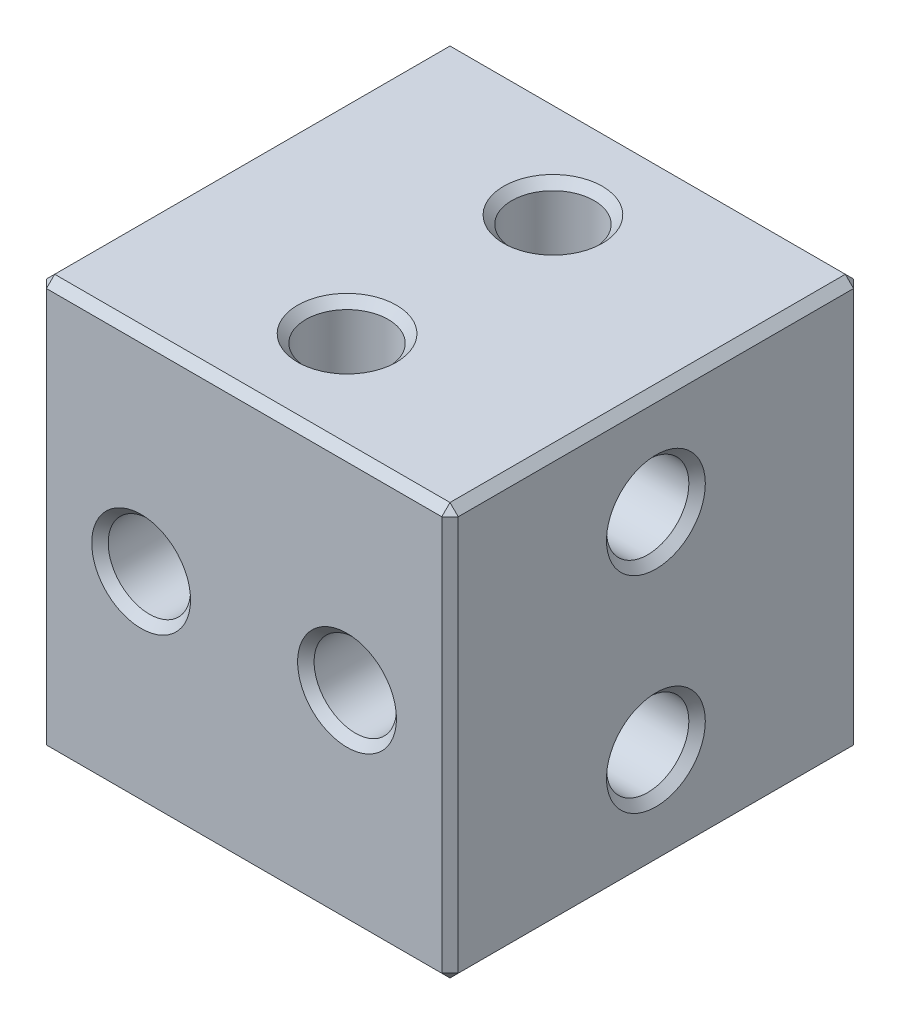
ISO-10303-21;
HEADER;
FILE_DESCRIPTION(('STEP AP214'),'2;1');
FILE_NAME('part.step','',(''),(''),'','','');
FILE_SCHEMA(('AUTOMOTIVE_DESIGN { 1 0 10303 214 1 1 1 1 }'));
ENDSEC;
DATA;
#1=APPLICATION_CONTEXT('core data for automotive mechanical design processes');
#2=APPLICATION_PROTOCOL_DEFINITION('international standard','automotive_design',2000,#1);
#3=PRODUCT_CONTEXT('',#1,'mechanical');
#4=PRODUCT('Part','Part','',(#3));
#5=PRODUCT_RELATED_PRODUCT_CATEGORY('part','',(#4));
#6=PRODUCT_DEFINITION_FORMATION('','',#4);
#7=PRODUCT_DEFINITION_CONTEXT('part definition',#1,'design');
#8=PRODUCT_DEFINITION('design','',#6,#7);
#9=PRODUCT_DEFINITION_SHAPE('','',#8);
#10=(LENGTH_UNIT() NAMED_UNIT(*) SI_UNIT(.MILLI.,.METRE.));
#11=(NAMED_UNIT(*) PLANE_ANGLE_UNIT() SI_UNIT($,.RADIAN.));
#12=(NAMED_UNIT(*) SI_UNIT($,.STERADIAN.) SOLID_ANGLE_UNIT());
#13=UNCERTAINTY_MEASURE_WITH_UNIT(LENGTH_MEASURE(1.E-05),#10,'distance_accuracy_value','');
#14=(GEOMETRIC_REPRESENTATION_CONTEXT(3) GLOBAL_UNCERTAINTY_ASSIGNED_CONTEXT((#13)) GLOBAL_UNIT_ASSIGNED_CONTEXT((#10,
#11,#12)) REPRESENTATION_CONTEXT('',''));
#15=CARTESIAN_POINT('',(0.,0.,0.));
#16=DIRECTION('',(0.,0.,1.));
#17=DIRECTION('',(1.,0.,0.));
#18=AXIS2_PLACEMENT_3D('',#15,#16,#17);
#19=CARTESIAN_POINT('',(-5.,5.,10.));
#20=DIRECTION('',(1.,0.,0.));
#21=DIRECTION('',(0.,1.,0.));
#22=AXIS2_PLACEMENT_3D('',#19,#20,#21);
#23=PLANE('',#22);
#24=CARTESIAN_POINT('',(-5.,-2.5,5.));
#25=DIRECTION('',(1.,0.,0.));
#26=DIRECTION('',(0.,1.,0.));
#27=AXIS2_PLACEMENT_3D('',#24,#25,#26);
#28=CIRCLE('',#27,1.2);
#29=CARTESIAN_POINT('',(-5.,-1.30000000000001,5.));
#30=VERTEX_POINT('',#29);
#31=EDGE_CURVE('E245',#30,#30,#28,.T.);
#32=ORIENTED_EDGE('',*,*,#31,.T.);
#33=EDGE_LOOP('',(#32));
#34=FACE_BOUND('',#33,.T.);
#35=CARTESIAN_POINT('',(-5.,2.5,5.));
#36=DIRECTION('',(1.,0.,0.));
#37=DIRECTION('',(0.,1.,0.));
#38=AXIS2_PLACEMENT_3D('',#35,#36,#37);
#39=CIRCLE('',#38,1.2);
#40=CARTESIAN_POINT('',(-5.,3.69999999999999,5.));
#41=VERTEX_POINT('',#40);
#42=EDGE_CURVE('E242',#41,#41,#39,.T.);
#43=ORIENTED_EDGE('',*,*,#42,.T.);
#44=EDGE_LOOP('',(#43));
#45=FACE_BOUND('',#44,.T.);
#46=DIRECTION('',(0.,-1.,0.));
#47=VECTOR('',#46,1.);
#48=CARTESIAN_POINT('',(-5.,5.,0.200000000000001));
#49=LINE('',#48,#47);
#50=CARTESIAN_POINT('',(-5.,4.8,0.200000000000001));
#51=VERTEX_POINT('',#50);
#52=CARTESIAN_POINT('',(-5.,-4.8,0.200000000000001));
#53=VERTEX_POINT('',#52);
#54=EDGE_CURVE('E500',#51,#53,#49,.T.);
#55=ORIENTED_EDGE('',*,*,#54,.T.);
#56=DIRECTION('',(0.,0.,1.));
#57=VECTOR('',#56,1.);
#58=CARTESIAN_POINT('',(-5.,-4.8,10.));
#59=LINE('',#58,#57);
#60=CARTESIAN_POINT('',(-5.,-4.8,9.8));
#61=VERTEX_POINT('',#60);
#62=EDGE_CURVE('E504',#53,#61,#59,.T.);
#63=ORIENTED_EDGE('',*,*,#62,.T.);
#64=DIRECTION('',(0.,1.,0.));
#65=VECTOR('',#64,1.);
#66=CARTESIAN_POINT('',(-5.,5.,9.8));
#67=LINE('',#66,#65);
#68=CARTESIAN_POINT('',(-5.,4.8,9.8));
#69=VERTEX_POINT('',#68);
#70=EDGE_CURVE('E502',#61,#69,#67,.T.);
#71=ORIENTED_EDGE('',*,*,#70,.T.);
#72=DIRECTION('',(0.,0.,-1.));
#73=VECTOR('',#72,1.);
#74=CARTESIAN_POINT('',(-5.,4.8,10.));
#75=LINE('',#74,#73);
#76=EDGE_CURVE('E481',#69,#51,#75,.T.);
#77=ORIENTED_EDGE('',*,*,#76,.T.);
#78=EDGE_LOOP('',(#55,#63,#71,#77));
#79=FACE_BOUND('',#78,.T.);
#80=ADVANCED_FACE('F32',(#34,#45,#79),#23,.F.);
#81=CARTESIAN_POINT('',(-5.,-5.,10.));
#82=DIRECTION('',(0.,1.,0.));
#83=DIRECTION('',(0.,0.,1.));
#84=AXIS2_PLACEMENT_3D('',#81,#82,#83);
#85=PLANE('',#84);
#86=CARTESIAN_POINT('',(0.,-5.,2.5));
#87=DIRECTION('',(0.,1.,0.));
#88=DIRECTION('',(0.,0.,1.));
#89=AXIS2_PLACEMENT_3D('',#86,#87,#88);
#90=CIRCLE('',#89,1.19999999999999);
#91=CARTESIAN_POINT('',(0.,-5.,3.69999999999999));
#92=VERTEX_POINT('',#91);
#93=EDGE_CURVE('E263',#92,#92,#90,.T.);
#94=ORIENTED_EDGE('',*,*,#93,.T.);
#95=EDGE_LOOP('',(#94));
#96=FACE_BOUND('',#95,.T.);
#97=CARTESIAN_POINT('',(0.,-5.,7.5));
#98=DIRECTION('',(0.,1.,0.));
#99=DIRECTION('',(0.,0.,1.));
#100=AXIS2_PLACEMENT_3D('',#97,#98,#99);
#101=CIRCLE('',#100,1.2);
#102=CARTESIAN_POINT('',(0.,-5.,8.7));
#103=VERTEX_POINT('',#102);
#104=EDGE_CURVE('E260',#103,#103,#101,.T.);
#105=ORIENTED_EDGE('',*,*,#104,.T.);
#106=EDGE_LOOP('',(#105));
#107=FACE_BOUND('',#106,.T.);
#108=DIRECTION('',(0.,0.,1.));
#109=VECTOR('',#108,1.);
#110=CARTESIAN_POINT('',(4.8,-5.,10.));
#111=LINE('',#110,#109);
#112=CARTESIAN_POINT('',(4.8,-5.,0.200000000000001));
#113=VERTEX_POINT('',#112);
#114=CARTESIAN_POINT('',(4.8,-5.,9.8));
#115=VERTEX_POINT('',#114);
#116=EDGE_CURVE('E461',#113,#115,#111,.T.);
#117=ORIENTED_EDGE('',*,*,#116,.T.);
#118=DIRECTION('',(-1.,0.,0.));
#119=VECTOR('',#118,1.);
#120=CARTESIAN_POINT('',(-5.,-5.,9.8));
#121=LINE('',#120,#119);
#122=CARTESIAN_POINT('',(-4.8,-5.,9.8));
#123=VERTEX_POINT('',#122);
#124=EDGE_CURVE('E464',#115,#123,#121,.T.);
#125=ORIENTED_EDGE('',*,*,#124,.T.);
#126=DIRECTION('',(0.,0.,-1.));
#127=VECTOR('',#126,1.);
#128=CARTESIAN_POINT('',(-4.8,-5.,10.));
#129=LINE('',#128,#127);
#130=CARTESIAN_POINT('',(-4.8,-5.,0.200000000000001));
#131=VERTEX_POINT('',#130);
#132=EDGE_CURVE('E468',#123,#131,#129,.T.);
#133=ORIENTED_EDGE('',*,*,#132,.T.);
#134=DIRECTION('',(1.,0.,0.));
#135=VECTOR('',#134,1.);
#136=CARTESIAN_POINT('',(-5.,-5.,0.200000000000001));
#137=LINE('',#136,#135);
#138=EDGE_CURVE('E466',#131,#113,#137,.T.);
#139=ORIENTED_EDGE('',*,*,#138,.T.);
#140=EDGE_LOOP('',(#117,#125,#133,#139));
#141=FACE_BOUND('',#140,.T.);
#142=ADVANCED_FACE('F293',(#96,#107,#141),#85,.F.);
#143=CARTESIAN_POINT('',(5.,5.,10.));
#144=DIRECTION('',(-1.,0.,0.));
#145=DIRECTION('',(0.,-1.,0.));
#146=AXIS2_PLACEMENT_3D('',#143,#144,#145);
#147=PLANE('',#146);
#148=CARTESIAN_POINT('',(5.,2.5,5.));
#149=DIRECTION('',(-1.,0.,0.));
#150=DIRECTION('',(0.,-1.,0.));
#151=AXIS2_PLACEMENT_3D('',#148,#149,#150);
#152=CIRCLE('',#151,1.2);
#153=CARTESIAN_POINT('',(5.,1.3,5.));
#154=VERTEX_POINT('',#153);
#155=EDGE_CURVE('E11',#154,#154,#152,.T.);
#156=ORIENTED_EDGE('',*,*,#155,.T.);
#157=EDGE_LOOP('',(#156));
#158=FACE_BOUND('',#157,.T.);
#159=CARTESIAN_POINT('',(5.,-2.5,5.));
#160=DIRECTION('',(-1.,0.,0.));
#161=DIRECTION('',(0.,-1.,0.));
#162=AXIS2_PLACEMENT_3D('',#159,#160,#161);
#163=CIRCLE('',#162,1.19999999999999);
#164=CARTESIAN_POINT('',(5.,-3.69999999999999,5.));
#165=VERTEX_POINT('',#164);
#166=EDGE_CURVE('E40',#165,#165,#163,.T.);
#167=ORIENTED_EDGE('',*,*,#166,.T.);
#168=EDGE_LOOP('',(#167));
#169=FACE_BOUND('',#168,.T.);
#170=DIRECTION('',(0.,0.,1.));
#171=VECTOR('',#170,1.);
#172=CARTESIAN_POINT('',(5.,4.8,10.));
#173=LINE('',#172,#171);
#174=CARTESIAN_POINT('',(5.,4.8,0.200000000000001));
#175=VERTEX_POINT('',#174);
#176=CARTESIAN_POINT('',(5.,4.8,9.8));
#177=VERTEX_POINT('',#176);
#178=EDGE_CURVE('E507',#175,#177,#173,.T.);
#179=ORIENTED_EDGE('',*,*,#178,.T.);
#180=DIRECTION('',(0.,-1.,0.));
#181=VECTOR('',#180,1.);
#182=CARTESIAN_POINT('',(5.,-5.,9.8));
#183=LINE('',#182,#181);
#184=CARTESIAN_POINT('',(5.,-4.8,9.8));
#185=VERTEX_POINT('',#184);
#186=EDGE_CURVE('E153',#177,#185,#183,.T.);
#187=ORIENTED_EDGE('',*,*,#186,.T.);
#188=DIRECTION('',(0.,0.,-1.));
#189=VECTOR('',#188,1.);
#190=CARTESIAN_POINT('',(5.,-4.8,10.));
#191=LINE('',#190,#189);
#192=CARTESIAN_POINT('',(5.,-4.8,0.200000000000001));
#193=VERTEX_POINT('',#192);
#194=EDGE_CURVE('E472',#185,#193,#191,.T.);
#195=ORIENTED_EDGE('',*,*,#194,.T.);
#196=DIRECTION('',(0.,1.,0.));
#197=VECTOR('',#196,1.);
#198=CARTESIAN_POINT('',(5.,5.,0.200000000000001));
#199=LINE('',#198,#197);
#200=EDGE_CURVE('E509',#193,#175,#199,.T.);
#201=ORIENTED_EDGE('',*,*,#200,.T.);
#202=EDGE_LOOP('',(#179,#187,#195,#201));
#203=FACE_BOUND('',#202,.T.);
#204=ADVANCED_FACE('F268',(#158,#169,#203),#147,.F.);
#205=CARTESIAN_POINT('',(-5.,5.,10.));
#206=DIRECTION('',(0.,-1.,0.));
#207=DIRECTION('',(0.,0.,-1.));
#208=AXIS2_PLACEMENT_3D('',#205,#206,#207);
#209=PLANE('',#208);
#210=CARTESIAN_POINT('',(0.,5.,2.5));
#211=DIRECTION('',(0.,-1.,0.));
#212=DIRECTION('',(0.,0.,-1.));
#213=AXIS2_PLACEMENT_3D('',#210,#211,#212);
#214=CIRCLE('',#213,1.2);
#215=CARTESIAN_POINT('',(0.,5.,1.3));
#216=VERTEX_POINT('',#215);
#217=EDGE_CURVE('E233',#216,#216,#214,.T.);
#218=ORIENTED_EDGE('',*,*,#217,.T.);
#219=EDGE_LOOP('',(#218));
#220=FACE_BOUND('',#219,.T.);
#221=CARTESIAN_POINT('',(0.,5.,7.5));
#222=DIRECTION('',(0.,-1.,0.));
#223=DIRECTION('',(0.,0.,-1.));
#224=AXIS2_PLACEMENT_3D('',#221,#222,#223);
#225=CIRCLE('',#224,1.2);
#226=CARTESIAN_POINT('',(0.,5.,6.3));
#227=VERTEX_POINT('',#226);
#228=EDGE_CURVE('E230',#227,#227,#225,.T.);
#229=ORIENTED_EDGE('',*,*,#228,.T.);
#230=EDGE_LOOP('',(#229));
#231=FACE_BOUND('',#230,.T.);
#232=DIRECTION('',(-1.,0.,0.));
#233=VECTOR('',#232,1.);
#234=CARTESIAN_POINT('',(-5.,5.,0.200000000000001));
#235=LINE('',#234,#233);
#236=CARTESIAN_POINT('',(4.8,5.,0.200000000000001));
#237=VERTEX_POINT('',#236);
#238=CARTESIAN_POINT('',(-4.8,5.,0.200000000000001));
#239=VERTEX_POINT('',#238);
#240=EDGE_CURVE('E522',#237,#239,#235,.T.);
#241=ORIENTED_EDGE('',*,*,#240,.T.);
#242=DIRECTION('',(0.,0.,1.));
#243=VECTOR('',#242,1.);
#244=CARTESIAN_POINT('',(-4.8,5.,10.));
#245=LINE('',#244,#243);
#246=CARTESIAN_POINT('',(-4.8,5.,9.8));
#247=VERTEX_POINT('',#246);
#248=EDGE_CURVE('E203',#239,#247,#245,.T.);
#249=ORIENTED_EDGE('',*,*,#248,.T.);
#250=DIRECTION('',(1.,0.,0.));
#251=VECTOR('',#250,1.);
#252=CARTESIAN_POINT('',(5.,5.,9.8));
#253=LINE('',#252,#251);
#254=CARTESIAN_POINT('',(4.8,5.,9.8));
#255=VERTEX_POINT('',#254);
#256=EDGE_CURVE('E55',#247,#255,#253,.T.);
#257=ORIENTED_EDGE('',*,*,#256,.T.);
#258=DIRECTION('',(0.,0.,-1.));
#259=VECTOR('',#258,1.);
#260=CARTESIAN_POINT('',(4.8,5.,10.));
#261=LINE('',#260,#259);
#262=EDGE_CURVE('E524',#255,#237,#261,.T.);
#263=ORIENTED_EDGE('',*,*,#262,.T.);
#264=EDGE_LOOP('',(#241,#249,#257,#263));
#265=FACE_BOUND('',#264,.T.);
#266=ADVANCED_FACE('F421',(#220,#231,#265),#209,.F.);
#267=CARTESIAN_POINT('',(-5.,-5.,10.));
#268=DIRECTION('',(0.,0.,1.));
#269=DIRECTION('',(1.,0.,0.));
#270=AXIS2_PLACEMENT_3D('',#267,#268,#269);
#271=PLANE('',#270);
#272=CARTESIAN_POINT('',(-2.5,0.,10.));
#273=DIRECTION('',(0.,0.,1.));
#274=DIRECTION('',(1.,0.,0.));
#275=AXIS2_PLACEMENT_3D('',#272,#273,#274);
#276=CIRCLE('',#275,1.19999999999999);
#277=CARTESIAN_POINT('',(-1.3,0.,10.));
#278=VERTEX_POINT('',#277);
#279=EDGE_CURVE('E221',#278,#278,#276,.F.);
#280=ORIENTED_EDGE('',*,*,#279,.T.);
#281=EDGE_LOOP('',(#280));
#282=FACE_BOUND('',#281,.T.);
#283=CARTESIAN_POINT('',(2.5,0.,10.));
#284=DIRECTION('',(0.,0.,1.));
#285=DIRECTION('',(1.,0.,0.));
#286=AXIS2_PLACEMENT_3D('',#283,#284,#285);
#287=CIRCLE('',#286,1.19999999999999);
#288=CARTESIAN_POINT('',(3.7,0.,10.));
#289=VERTEX_POINT('',#288);
#290=EDGE_CURVE('E218',#289,#289,#287,.F.);
#291=ORIENTED_EDGE('',*,*,#290,.T.);
#292=EDGE_LOOP('',(#291));
#293=FACE_BOUND('',#292,.T.);
#294=DIRECTION('',(0.,-1.,0.));
#295=VECTOR('',#294,1.);
#296=CARTESIAN_POINT('',(-4.8,-5.,10.));
#297=LINE('',#296,#295);
#298=CARTESIAN_POINT('',(-4.8,4.8,10.));
#299=VERTEX_POINT('',#298);
#300=CARTESIAN_POINT('',(-4.8,-4.8,10.));
#301=VERTEX_POINT('',#300);
#302=EDGE_CURVE('E133',#299,#301,#297,.T.);
#303=ORIENTED_EDGE('',*,*,#302,.T.);
#304=DIRECTION('',(1.,0.,0.));
#305=VECTOR('',#304,1.);
#306=CARTESIAN_POINT('',(5.,-4.8,10.));
#307=LINE('',#306,#305);
#308=CARTESIAN_POINT('',(4.8,-4.8,10.));
#309=VERTEX_POINT('',#308);
#310=EDGE_CURVE('E129',#301,#309,#307,.T.);
#311=ORIENTED_EDGE('',*,*,#310,.T.);
#312=DIRECTION('',(0.,1.,0.));
#313=VECTOR('',#312,1.);
#314=CARTESIAN_POINT('',(4.8,5.,10.));
#315=LINE('',#314,#313);
#316=CARTESIAN_POINT('',(4.8,4.8,10.));
#317=VERTEX_POINT('',#316);
#318=EDGE_CURVE('E124',#309,#317,#315,.T.);
#319=ORIENTED_EDGE('',*,*,#318,.T.);
#320=DIRECTION('',(-1.,0.,0.));
#321=VECTOR('',#320,1.);
#322=CARTESIAN_POINT('',(-5.,4.8,10.));
#323=LINE('',#322,#321);
#324=EDGE_CURVE('E127',#317,#299,#323,.T.);
#325=ORIENTED_EDGE('',*,*,#324,.T.);
#326=EDGE_LOOP('',(#303,#311,#319,#325));
#327=FACE_BOUND('',#326,.T.);
#328=ADVANCED_FACE('F126',(#282,#293,#327),#271,.T.);
#329=CARTESIAN_POINT('',(-5.,-5.,0.));
#330=DIRECTION('',(0.,0.,1.));
#331=DIRECTION('',(1.,0.,0.));
#332=AXIS2_PLACEMENT_3D('',#329,#330,#331);
#333=PLANE('',#332);
#334=CARTESIAN_POINT('',(-2.5,0.,0.));
#335=DIRECTION('',(0.,0.,1.));
#336=DIRECTION('',(1.,0.,0.));
#337=AXIS2_PLACEMENT_3D('',#334,#335,#336);
#338=CIRCLE('',#337,1.2);
#339=CARTESIAN_POINT('',(-1.3,0.,0.));
#340=VERTEX_POINT('',#339);
#341=EDGE_CURVE('E202',#340,#340,#338,.T.);
#342=ORIENTED_EDGE('',*,*,#341,.T.);
#343=EDGE_LOOP('',(#342));
#344=FACE_BOUND('',#343,.T.);
#345=CARTESIAN_POINT('',(2.5,0.,0.));
#346=DIRECTION('',(0.,0.,1.));
#347=DIRECTION('',(1.,0.,0.));
#348=AXIS2_PLACEMENT_3D('',#345,#346,#347);
#349=CIRCLE('',#348,1.2);
#350=CARTESIAN_POINT('',(3.7,0.,0.));
#351=VERTEX_POINT('',#350);
#352=EDGE_CURVE('E199',#351,#351,#349,.T.);
#353=ORIENTED_EDGE('',*,*,#352,.T.);
#354=EDGE_LOOP('',(#353));
#355=FACE_BOUND('',#354,.T.);
#356=DIRECTION('',(0.,-1.,0.));
#357=VECTOR('',#356,1.);
#358=CARTESIAN_POINT('',(4.8,-5.,0.));
#359=LINE('',#358,#357);
#360=CARTESIAN_POINT('',(4.8,4.8,0.));
#361=VERTEX_POINT('',#360);
#362=CARTESIAN_POINT('',(4.8,-4.8,0.));
#363=VERTEX_POINT('',#362);
#364=EDGE_CURVE('E517',#361,#363,#359,.T.);
#365=ORIENTED_EDGE('',*,*,#364,.T.);
#366=DIRECTION('',(-1.,0.,0.));
#367=VECTOR('',#366,1.);
#368=CARTESIAN_POINT('',(-5.,-4.8,0.));
#369=LINE('',#368,#367);
#370=CARTESIAN_POINT('',(-4.8,-4.8,0.));
#371=VERTEX_POINT('',#370);
#372=EDGE_CURVE('E519',#363,#371,#369,.T.);
#373=ORIENTED_EDGE('',*,*,#372,.T.);
#374=DIRECTION('',(0.,1.,0.));
#375=VECTOR('',#374,1.);
#376=CARTESIAN_POINT('',(-4.8,-5.,0.));
#377=LINE('',#376,#375);
#378=CARTESIAN_POINT('',(-4.8,4.8,0.));
#379=VERTEX_POINT('',#378);
#380=EDGE_CURVE('E515',#371,#379,#377,.T.);
#381=ORIENTED_EDGE('',*,*,#380,.T.);
#382=DIRECTION('',(1.,0.,0.));
#383=VECTOR('',#382,1.);
#384=CARTESIAN_POINT('',(-5.,4.8,0.));
#385=LINE('',#384,#383);
#386=EDGE_CURVE('E513',#379,#361,#385,.T.);
#387=ORIENTED_EDGE('',*,*,#386,.T.);
#388=EDGE_LOOP('',(#365,#373,#381,#387));
#389=FACE_BOUND('',#388,.T.);
#390=ADVANCED_FACE('F428',(#344,#355,#389),#333,.F.);
#391=CARTESIAN_POINT('',(-2.5,0.,0.));
#392=DIRECTION('',(0.,0.,1.));
#393=DIRECTION('',(1.,0.,0.));
#394=AXIS2_PLACEMENT_3D('',#391,#392,#393);
#395=CYLINDRICAL_SURFACE('',#394,1.);
#396=CARTESIAN_POINT('',(-2.5,0.,0.200000000000004));
#397=DIRECTION('',(0.,0.,1.));
#398=DIRECTION('',(1.,0.,0.));
#399=AXIS2_PLACEMENT_3D('',#396,#397,#398);
#400=CIRCLE('',#399,1.);
#401=CARTESIAN_POINT('',(-1.5,0.,0.200000000000004));
#402=VERTEX_POINT('',#401);
#403=EDGE_CURVE('E209',#402,#402,#400,.F.);
#404=ORIENTED_EDGE('',*,*,#403,.T.);
#405=EDGE_LOOP('',(#404));
#406=FACE_BOUND('',#405,.T.);
#407=CARTESIAN_POINT('',(-2.5,0.,9.8));
#408=DIRECTION('',(0.,0.,1.));
#409=DIRECTION('',(1.,0.,0.));
#410=AXIS2_PLACEMENT_3D('',#407,#408,#409);
#411=CIRCLE('',#410,1.);
#412=CARTESIAN_POINT('',(-1.5,0.,9.8));
#413=VERTEX_POINT('',#412);
#414=EDGE_CURVE('E206',#413,#413,#411,.T.);
#415=ORIENTED_EDGE('',*,*,#414,.T.);
#416=EDGE_LOOP('',(#415));
#417=FACE_BOUND('',#416,.T.);
#418=ADVANCED_FACE('F431',(#406,#417),#395,.F.);
#419=CARTESIAN_POINT('',(2.5,0.,0.));
#420=DIRECTION('',(0.,0.,1.));
#421=DIRECTION('',(1.,0.,0.));
#422=AXIS2_PLACEMENT_3D('',#419,#420,#421);
#423=CYLINDRICAL_SURFACE('',#422,1.);
#424=CARTESIAN_POINT('',(2.5,0.,0.200000000000004));
#425=DIRECTION('',(0.,0.,1.));
#426=DIRECTION('',(1.,0.,0.));
#427=AXIS2_PLACEMENT_3D('',#424,#425,#426);
#428=CIRCLE('',#427,1.);
#429=CARTESIAN_POINT('',(3.5,0.,0.200000000000004));
#430=VERTEX_POINT('',#429);
#431=EDGE_CURVE('E215',#430,#430,#428,.F.);
#432=ORIENTED_EDGE('',*,*,#431,.T.);
#433=EDGE_LOOP('',(#432));
#434=FACE_BOUND('',#433,.T.);
#435=CARTESIAN_POINT('',(2.5,0.,9.8));
#436=DIRECTION('',(0.,0.,1.));
#437=DIRECTION('',(1.,0.,0.));
#438=AXIS2_PLACEMENT_3D('',#435,#436,#437);
#439=CIRCLE('',#438,1.);
#440=CARTESIAN_POINT('',(3.5,0.,9.8));
#441=VERTEX_POINT('',#440);
#442=EDGE_CURVE('E212',#441,#441,#439,.T.);
#443=ORIENTED_EDGE('',*,*,#442,.T.);
#444=EDGE_LOOP('',(#443));
#445=FACE_BOUND('',#444,.T.);
#446=ADVANCED_FACE('F438',(#434,#445),#423,.F.);
#447=CARTESIAN_POINT('',(0.,-5.,7.5));
#448=DIRECTION('',(0.,1.,0.));
#449=DIRECTION('',(0.,0.,1.));
#450=AXIS2_PLACEMENT_3D('',#447,#448,#449);
#451=CYLINDRICAL_SURFACE('',#450,1.);
#452=CARTESIAN_POINT('',(0.,4.8,7.5));
#453=DIRECTION('',(0.,-1.,0.));
#454=DIRECTION('',(0.,0.,-1.));
#455=AXIS2_PLACEMENT_3D('',#452,#453,#454);
#456=CIRCLE('',#455,1.);
#457=CARTESIAN_POINT('',(0.,4.8,6.5));
#458=VERTEX_POINT('',#457);
#459=EDGE_CURVE('E239',#458,#458,#456,.F.);
#460=ORIENTED_EDGE('',*,*,#459,.T.);
#461=EDGE_LOOP('',(#460));
#462=FACE_BOUND('',#461,.T.);
#463=CARTESIAN_POINT('',(0.,-4.8,7.5));
#464=DIRECTION('',(0.,1.,0.));
#465=DIRECTION('',(0.,0.,1.));
#466=AXIS2_PLACEMENT_3D('',#463,#464,#465);
#467=CIRCLE('',#466,1.);
#468=CARTESIAN_POINT('',(0.,-4.8,8.5));
#469=VERTEX_POINT('',#468);
#470=EDGE_CURVE('E236',#469,#469,#467,.F.);
#471=ORIENTED_EDGE('',*,*,#470,.T.);
#472=EDGE_LOOP('',(#471));
#473=FACE_BOUND('',#472,.T.);
#474=ADVANCED_FACE('F442',(#462,#473),#451,.F.);
#475=CARTESIAN_POINT('',(0.,-5.,2.5));
#476=DIRECTION('',(0.,1.,0.));
#477=DIRECTION('',(0.,0.,1.));
#478=AXIS2_PLACEMENT_3D('',#475,#476,#477);
#479=CYLINDRICAL_SURFACE('',#478,1.);
#480=CARTESIAN_POINT('',(0.,4.8,2.5));
#481=DIRECTION('',(0.,-1.,0.));
#482=DIRECTION('',(0.,0.,-1.));
#483=AXIS2_PLACEMENT_3D('',#480,#481,#482);
#484=CIRCLE('',#483,1.);
#485=CARTESIAN_POINT('',(0.,4.8,1.5));
#486=VERTEX_POINT('',#485);
#487=EDGE_CURVE('E227',#486,#486,#484,.F.);
#488=ORIENTED_EDGE('',*,*,#487,.T.);
#489=EDGE_LOOP('',(#488));
#490=FACE_BOUND('',#489,.T.);
#491=CARTESIAN_POINT('',(0.,-4.80000000000001,2.5));
#492=DIRECTION('',(0.,1.,0.));
#493=DIRECTION('',(0.,0.,1.));
#494=AXIS2_PLACEMENT_3D('',#491,#492,#493);
#495=CIRCLE('',#494,1.);
#496=CARTESIAN_POINT('',(0.,-4.80000000000001,3.5));
#497=VERTEX_POINT('',#496);
#498=EDGE_CURVE('E224',#497,#497,#495,.F.);
#499=ORIENTED_EDGE('',*,*,#498,.T.);
#500=EDGE_LOOP('',(#499));
#501=FACE_BOUND('',#500,.T.);
#502=ADVANCED_FACE('F289',(#490,#501),#479,.F.);
#503=CARTESIAN_POINT('',(-5.,2.5,5.));
#504=DIRECTION('',(1.,0.,0.));
#505=DIRECTION('',(0.,1.,0.));
#506=AXIS2_PLACEMENT_3D('',#503,#504,#505);
#507=CYLINDRICAL_SURFACE('',#506,1.);
#508=CARTESIAN_POINT('',(-4.80000000000001,2.5,5.));
#509=DIRECTION('',(1.,0.,0.));
#510=DIRECTION('',(0.,0.,-1.));
#511=AXIS2_PLACEMENT_3D('',#508,#509,#510);
#512=CIRCLE('',#511,1.);
#513=CARTESIAN_POINT('',(-4.80000000000001,2.5,4.));
#514=VERTEX_POINT('',#513);
#515=EDGE_CURVE('E257',#514,#514,#512,.F.);
#516=ORIENTED_EDGE('',*,*,#515,.T.);
#517=EDGE_LOOP('',(#516));
#518=FACE_BOUND('',#517,.T.);
#519=CARTESIAN_POINT('',(4.8,2.5,5.));
#520=DIRECTION('',(-1.,0.,0.));
#521=DIRECTION('',(0.,0.,1.));
#522=AXIS2_PLACEMENT_3D('',#519,#520,#521);
#523=CIRCLE('',#522,1.);
#524=CARTESIAN_POINT('',(4.8,2.5,6.));
#525=VERTEX_POINT('',#524);
#526=EDGE_CURVE('E254',#525,#525,#523,.F.);
#527=ORIENTED_EDGE('',*,*,#526,.T.);
#528=EDGE_LOOP('',(#527));
#529=FACE_BOUND('',#528,.T.);
#530=ADVANCED_FACE('F279',(#518,#529),#507,.F.);
#531=CARTESIAN_POINT('',(-5.,-2.5,5.));
#532=DIRECTION('',(1.,0.,0.));
#533=DIRECTION('',(0.,1.,0.));
#534=AXIS2_PLACEMENT_3D('',#531,#532,#533);
#535=CYLINDRICAL_SURFACE('',#534,1.);
#536=CARTESIAN_POINT('',(-4.8,-2.5,5.));
#537=DIRECTION('',(1.,0.,0.));
#538=DIRECTION('',(0.,0.,-1.));
#539=AXIS2_PLACEMENT_3D('',#536,#537,#538);
#540=CIRCLE('',#539,1.);
#541=CARTESIAN_POINT('',(-4.8,-2.5,4.));
#542=VERTEX_POINT('',#541);
#543=EDGE_CURVE('E251',#542,#542,#540,.F.);
#544=ORIENTED_EDGE('',*,*,#543,.T.);
#545=EDGE_LOOP('',(#544));
#546=FACE_BOUND('',#545,.T.);
#547=CARTESIAN_POINT('',(4.80000000000001,-2.5,5.));
#548=DIRECTION('',(-1.,0.,0.));
#549=DIRECTION('',(0.,0.,1.));
#550=AXIS2_PLACEMENT_3D('',#547,#548,#549);
#551=CIRCLE('',#550,1.);
#552=CARTESIAN_POINT('',(4.80000000000001,-2.5,6.));
#553=VERTEX_POINT('',#552);
#554=EDGE_CURVE('E248',#553,#553,#551,.F.);
#555=ORIENTED_EDGE('',*,*,#554,.T.);
#556=EDGE_LOOP('',(#555));
#557=FACE_BOUND('',#556,.T.);
#558=ADVANCED_FACE('F276',(#546,#557),#535,.F.);
#559=CARTESIAN_POINT('',(-5.,5.,0.200000000000001));
#560=DIRECTION('',(0.,-0.707106781186551,0.707106781186544));
#561=DIRECTION('',(0.,-0.707106781186544,-0.707106781186551));
#562=AXIS2_PLACEMENT_3D('',#559,#560,#561);
#563=PLANE('',#562);
#564=DIRECTION('',(0.,0.707106781186544,0.70710678118655));
#565=VECTOR('',#564,1.);
#566=CARTESIAN_POINT('',(-4.8,4.8,0.));
#567=LINE('',#566,#565);
#568=EDGE_CURVE('E141',#239,#379,#567,.F.);
#569=ORIENTED_EDGE('',*,*,#568,.F.);
#570=ORIENTED_EDGE('',*,*,#240,.F.);
#571=DIRECTION('',(0.,-0.707106781186544,-0.70710678118655));
#572=VECTOR('',#571,1.);
#573=CARTESIAN_POINT('',(4.8,4.9,0.100000000000001));
#574=LINE('',#573,#572);
#575=EDGE_CURVE('E194',#361,#237,#574,.F.);
#576=ORIENTED_EDGE('',*,*,#575,.F.);
#577=ORIENTED_EDGE('',*,*,#386,.F.);
#578=EDGE_LOOP('',(#569,#570,#576,#577));
#579=FACE_BOUND('',#578,.T.);
#580=ADVANCED_FACE('F278',(#579),#563,.F.);
#581=CARTESIAN_POINT('',(-4.8,4.8,0.));
#582=DIRECTION('',(-0.577350269189625,0.57735026918963,-0.577350269189622));
#583=DIRECTION('',(-0.707106781186551,-0.707106781186545,0.));
#584=AXIS2_PLACEMENT_3D('',#581,#582,#583);
#585=PLANE('',#584);
#586=DIRECTION('',(-0.707106781186551,-0.707106781186544,0.));
#587=VECTOR('',#586,1.);
#588=CARTESIAN_POINT('',(-4.9,4.9,0.200000000000001));
#589=LINE('',#588,#587);
#590=EDGE_CURVE('E188',#239,#51,#589,.T.);
#591=ORIENTED_EDGE('',*,*,#590,.F.);
#592=ORIENTED_EDGE('',*,*,#568,.T.);
#593=DIRECTION('',(0.707106781186546,0.,-0.707106781186549));
#594=VECTOR('',#593,1.);
#595=CARTESIAN_POINT('',(-4.8,4.8,0.));
#596=LINE('',#595,#594);
#597=EDGE_CURVE('E191',#51,#379,#596,.T.);
#598=ORIENTED_EDGE('',*,*,#597,.F.);
#599=EDGE_LOOP('',(#591,#592,#598));
#600=FACE_BOUND('',#599,.T.);
#601=ADVANCED_FACE('F286',(#600),#585,.T.);
#602=CARTESIAN_POINT('',(5.,4.8,0.200000000000001));
#603=DIRECTION('',(0.577350269189625,0.57735026918963,-0.577350269189622));
#604=DIRECTION('',(-0.707106781186551,0.707106781186545,0.));
#605=AXIS2_PLACEMENT_3D('',#602,#603,#604);
#606=PLANE('',#605);
#607=DIRECTION('',(0.707106781186546,0.,0.707106781186549));
#608=VECTOR('',#607,1.);
#609=CARTESIAN_POINT('',(5.,4.8,0.200000000000001));
#610=LINE('',#609,#608);
#611=EDGE_CURVE('E182',#361,#175,#610,.T.);
#612=ORIENTED_EDGE('',*,*,#611,.F.);
#613=ORIENTED_EDGE('',*,*,#575,.T.);
#614=DIRECTION('',(-0.707106781186551,0.707106781186544,0.));
#615=VECTOR('',#614,1.);
#616=CARTESIAN_POINT('',(5.,4.8,0.200000000000001));
#617=LINE('',#616,#615);
#618=EDGE_CURVE('E185',#175,#237,#617,.T.);
#619=ORIENTED_EDGE('',*,*,#618,.F.);
#620=EDGE_LOOP('',(#612,#613,#619));
#621=FACE_BOUND('',#620,.T.);
#622=ADVANCED_FACE('F365',(#621),#606,.T.);
#623=CARTESIAN_POINT('',(-5.,5.,0.200000000000001));
#624=DIRECTION('',(0.707106781186549,0.,0.707106781186546));
#625=DIRECTION('',(0.707106781186546,0.,-0.707106781186549));
#626=AXIS2_PLACEMENT_3D('',#623,#624,#625);
#627=PLANE('',#626);
#628=ORIENTED_EDGE('',*,*,#597,.T.);
#629=ORIENTED_EDGE('',*,*,#380,.F.);
#630=DIRECTION('',(-0.707106781186546,0.,0.707106781186549));
#631=VECTOR('',#630,1.);
#632=CARTESIAN_POINT('',(-4.9,-4.8,0.1));
#633=LINE('',#632,#631);
#634=EDGE_CURVE('E177',#53,#371,#633,.F.);
#635=ORIENTED_EDGE('',*,*,#634,.F.);
#636=ORIENTED_EDGE('',*,*,#54,.F.);
#637=EDGE_LOOP('',(#628,#629,#635,#636));
#638=FACE_BOUND('',#637,.T.);
#639=ADVANCED_FACE('F361',(#638),#627,.F.);
#640=CARTESIAN_POINT('',(-5.,4.8,10.));
#641=DIRECTION('',(0.707106781186544,-0.707106781186551,0.));
#642=DIRECTION('',(0.707106781186551,0.707106781186544,0.));
#643=AXIS2_PLACEMENT_3D('',#640,#641,#642);
#644=PLANE('',#643);
#645=ORIENTED_EDGE('',*,*,#590,.T.);
#646=ORIENTED_EDGE('',*,*,#76,.F.);
#647=DIRECTION('',(0.707106781186551,0.707106781186545,0.));
#648=VECTOR('',#647,1.);
#649=CARTESIAN_POINT('',(-5.,4.8,9.8));
#650=LINE('',#649,#648);
#651=EDGE_CURVE('E175',#247,#69,#650,.F.);
#652=ORIENTED_EDGE('',*,*,#651,.F.);
#653=ORIENTED_EDGE('',*,*,#248,.F.);
#654=EDGE_LOOP('',(#645,#646,#652,#653));
#655=FACE_BOUND('',#654,.T.);
#656=ADVANCED_FACE('F358',(#655),#644,.F.);
#657=CARTESIAN_POINT('',(-5.,4.8,10.));
#658=DIRECTION('',(0.,0.707106781186551,0.707106781186544));
#659=DIRECTION('',(0.,-0.707106781186544,0.707106781186551));
#660=AXIS2_PLACEMENT_3D('',#657,#658,#659);
#661=PLANE('',#660);
#662=DIRECTION('',(0.,-0.707106781186544,0.707106781186551));
#663=VECTOR('',#662,1.);
#664=CARTESIAN_POINT('',(4.8,4.8,10.));
#665=LINE('',#664,#663);
#666=EDGE_CURVE('E139',#255,#317,#665,.T.);
#667=ORIENTED_EDGE('',*,*,#666,.F.);
#668=ORIENTED_EDGE('',*,*,#256,.F.);
#669=DIRECTION('',(0.,0.707106781186544,-0.707106781186551));
#670=VECTOR('',#669,1.);
#671=CARTESIAN_POINT('',(-4.8,4.9,9.9));
#672=LINE('',#671,#670);
#673=EDGE_CURVE('E47',#299,#247,#672,.T.);
#674=ORIENTED_EDGE('',*,*,#673,.F.);
#675=ORIENTED_EDGE('',*,*,#324,.F.);
#676=EDGE_LOOP('',(#667,#668,#674,#675));
#677=FACE_BOUND('',#676,.T.);
#678=ADVANCED_FACE('F138',(#677),#661,.T.);
#679=CARTESIAN_POINT('',(4.8,5.,10.));
#680=DIRECTION('',(-0.707106781186544,-0.707106781186551,0.));
#681=DIRECTION('',(0.707106781186551,-0.707106781186544,0.));
#682=AXIS2_PLACEMENT_3D('',#679,#680,#681);
#683=PLANE('',#682);
#684=ORIENTED_EDGE('',*,*,#618,.T.);
#685=ORIENTED_EDGE('',*,*,#262,.F.);
#686=DIRECTION('',(0.707106781186551,-0.707106781186544,0.));
#687=VECTOR('',#686,1.);
#688=CARTESIAN_POINT('',(4.9,4.9,9.8));
#689=LINE('',#688,#687);
#690=EDGE_CURVE('E149',#177,#255,#689,.F.);
#691=ORIENTED_EDGE('',*,*,#690,.F.);
#692=ORIENTED_EDGE('',*,*,#178,.F.);
#693=EDGE_LOOP('',(#684,#685,#691,#692));
#694=FACE_BOUND('',#693,.T.);
#695=ADVANCED_FACE('F351',(#694),#683,.F.);
#696=CARTESIAN_POINT('',(5.,5.,0.200000000000001));
#697=DIRECTION('',(-0.707106781186549,0.,0.707106781186546));
#698=DIRECTION('',(0.707106781186546,0.,0.707106781186549));
#699=AXIS2_PLACEMENT_3D('',#696,#697,#698);
#700=PLANE('',#699);
#701=ORIENTED_EDGE('',*,*,#611,.T.);
#702=ORIENTED_EDGE('',*,*,#200,.F.);
#703=DIRECTION('',(-0.707106781186546,0.,-0.707106781186549));
#704=VECTOR('',#703,1.);
#705=CARTESIAN_POINT('',(5.,-4.8,0.200000000000001));
#706=LINE('',#705,#704);
#707=EDGE_CURVE('E170',#363,#193,#706,.F.);
#708=ORIENTED_EDGE('',*,*,#707,.F.);
#709=ORIENTED_EDGE('',*,*,#364,.F.);
#710=EDGE_LOOP('',(#701,#702,#708,#709));
#711=FACE_BOUND('',#710,.T.);
#712=ADVANCED_FACE('F347',(#711),#700,.F.);
#713=CARTESIAN_POINT('',(-5.,-5.,0.200000000000001));
#714=DIRECTION('',(0.,0.707106781186551,0.707106781186544));
#715=DIRECTION('',(0.,-0.707106781186544,0.707106781186551));
#716=AXIS2_PLACEMENT_3D('',#713,#714,#715);
#717=PLANE('',#716);
#718=DIRECTION('',(0.,0.707106781186544,-0.70710678118655));
#719=VECTOR('',#718,1.);
#720=CARTESIAN_POINT('',(-4.8,-5.,0.200000000000001));
#721=LINE('',#720,#719);
#722=EDGE_CURVE('E179',#371,#131,#721,.F.);
#723=ORIENTED_EDGE('',*,*,#722,.F.);
#724=ORIENTED_EDGE('',*,*,#372,.F.);
#725=DIRECTION('',(0.,-0.707106781186544,0.707106781186551));
#726=VECTOR('',#725,1.);
#727=CARTESIAN_POINT('',(4.8,-4.9,0.1));
#728=LINE('',#727,#726);
#729=EDGE_CURVE('E167',#113,#363,#728,.F.);
#730=ORIENTED_EDGE('',*,*,#729,.F.);
#731=ORIENTED_EDGE('',*,*,#138,.F.);
#732=EDGE_LOOP('',(#723,#724,#730,#731));
#733=FACE_BOUND('',#732,.T.);
#734=ADVANCED_FACE('F343',(#733),#717,.F.);
#735=CARTESIAN_POINT('',(-4.8,-5.,0.200000000000001));
#736=DIRECTION('',(-0.577350269189625,-0.57735026918963,-0.577350269189622));
#737=DIRECTION('',(0.707106781186551,-0.707106781186545,0.));
#738=AXIS2_PLACEMENT_3D('',#735,#736,#737);
#739=PLANE('',#738);
#740=ORIENTED_EDGE('',*,*,#634,.T.);
#741=ORIENTED_EDGE('',*,*,#722,.T.);
#742=DIRECTION('',(0.707106781186551,-0.707106781186544,0.));
#743=VECTOR('',#742,1.);
#744=CARTESIAN_POINT('',(-4.8,-5.,0.200000000000001));
#745=LINE('',#744,#743);
#746=EDGE_CURVE('E158',#53,#131,#745,.T.);
#747=ORIENTED_EDGE('',*,*,#746,.F.);
#748=EDGE_LOOP('',(#740,#741,#747));
#749=FACE_BOUND('',#748,.T.);
#750=ADVANCED_FACE('F340',(#749),#739,.T.);
#751=CARTESIAN_POINT('',(-5.,4.8,9.8));
#752=DIRECTION('',(-0.57735026918962,0.57735026918963,0.577350269189627));
#753=DIRECTION('',(0.,-0.707106781186546,0.707106781186549));
#754=AXIS2_PLACEMENT_3D('',#751,#752,#753);
#755=PLANE('',#754);
#756=ORIENTED_EDGE('',*,*,#673,.T.);
#757=ORIENTED_EDGE('',*,*,#651,.T.);
#758=DIRECTION('',(0.707106781186552,0.,0.707106781186543));
#759=VECTOR('',#758,1.);
#760=CARTESIAN_POINT('',(-5.,4.8,9.8));
#761=LINE('',#760,#759);
#762=EDGE_CURVE('E154',#299,#69,#761,.F.);
#763=ORIENTED_EDGE('',*,*,#762,.F.);
#764=EDGE_LOOP('',(#756,#757,#763));
#765=FACE_BOUND('',#764,.T.);
#766=ADVANCED_FACE('F337',(#765),#755,.T.);
#767=CARTESIAN_POINT('',(4.8,4.8,10.));
#768=DIRECTION('',(0.577350269189622,0.577350269189632,0.577350269189624));
#769=DIRECTION('',(0.,-0.707106781186543,0.707106781186552));
#770=AXIS2_PLACEMENT_3D('',#767,#768,#769);
#771=PLANE('',#770);
#772=ORIENTED_EDGE('',*,*,#690,.T.);
#773=ORIENTED_EDGE('',*,*,#666,.T.);
#774=DIRECTION('',(0.707106781186549,0.,-0.707106781186546));
#775=VECTOR('',#774,1.);
#776=CARTESIAN_POINT('',(4.8,4.8,10.));
#777=LINE('',#776,#775);
#778=EDGE_CURVE('E146',#177,#317,#777,.F.);
#779=ORIENTED_EDGE('',*,*,#778,.F.);
#780=EDGE_LOOP('',(#772,#773,#779));
#781=FACE_BOUND('',#780,.T.);
#782=ADVANCED_FACE('F145',(#781),#771,.T.);
#783=CARTESIAN_POINT('',(5.,-4.8,0.200000000000001));
#784=DIRECTION('',(0.577350269189629,-0.577350269189627,-0.577350269189622));
#785=DIRECTION('',(0.707106781186546,0.707106781186549,0.));
#786=AXIS2_PLACEMENT_3D('',#783,#784,#785);
#787=PLANE('',#786);
#788=ORIENTED_EDGE('',*,*,#729,.T.);
#789=ORIENTED_EDGE('',*,*,#707,.T.);
#790=DIRECTION('',(0.707106781186546,0.707106781186549,0.));
#791=VECTOR('',#790,1.);
#792=CARTESIAN_POINT('',(5.,-4.8,0.200000000000001));
#793=LINE('',#792,#791);
#794=EDGE_CURVE('E155',#113,#193,#793,.T.);
#795=ORIENTED_EDGE('',*,*,#794,.F.);
#796=EDGE_LOOP('',(#788,#789,#795));
#797=FACE_BOUND('',#796,.T.);
#798=ADVANCED_FACE('F330',(#797),#787,.T.);
#799=CARTESIAN_POINT('',(-4.8,-5.,10.));
#800=DIRECTION('',(0.707106781186544,0.707106781186551,0.));
#801=DIRECTION('',(-0.707106781186551,0.707106781186544,0.));
#802=AXIS2_PLACEMENT_3D('',#799,#800,#801);
#803=PLANE('',#802);
#804=ORIENTED_EDGE('',*,*,#746,.T.);
#805=ORIENTED_EDGE('',*,*,#132,.F.);
#806=DIRECTION('',(-0.707106781186551,0.707106781186544,0.));
#807=VECTOR('',#806,1.);
#808=CARTESIAN_POINT('',(-4.8,-5.,9.8));
#809=LINE('',#808,#807);
#810=EDGE_CURVE('E161',#61,#123,#809,.F.);
#811=ORIENTED_EDGE('',*,*,#810,.F.);
#812=ORIENTED_EDGE('',*,*,#62,.F.);
#813=EDGE_LOOP('',(#804,#805,#811,#812));
#814=FACE_BOUND('',#813,.T.);
#815=ADVANCED_FACE('F326',(#814),#803,.F.);
#816=CARTESIAN_POINT('',(-4.8,-5.,10.));
#817=DIRECTION('',(-0.707106781186543,0.,0.707106781186552));
#818=DIRECTION('',(0.707106781186552,0.,0.707106781186543));
#819=AXIS2_PLACEMENT_3D('',#816,#817,#818);
#820=PLANE('',#819);
#821=ORIENTED_EDGE('',*,*,#762,.T.);
#822=ORIENTED_EDGE('',*,*,#70,.F.);
#823=DIRECTION('',(-0.707106781186552,0.,-0.707106781186543));
#824=VECTOR('',#823,1.);
#825=CARTESIAN_POINT('',(-4.9,-4.8,9.9));
#826=LINE('',#825,#824);
#827=EDGE_CURVE('E489',#301,#61,#826,.T.);
#828=ORIENTED_EDGE('',*,*,#827,.F.);
#829=ORIENTED_EDGE('',*,*,#302,.F.);
#830=EDGE_LOOP('',(#821,#822,#828,#829));
#831=FACE_BOUND('',#830,.T.);
#832=ADVANCED_FACE('F323',(#831),#820,.T.);
#833=CARTESIAN_POINT('',(4.8,-5.,10.));
#834=DIRECTION('',(0.707106781186546,0.,0.707106781186549));
#835=DIRECTION('',(0.707106781186549,0.,-0.707106781186546));
#836=AXIS2_PLACEMENT_3D('',#833,#834,#835);
#837=PLANE('',#836);
#838=ORIENTED_EDGE('',*,*,#778,.T.);
#839=ORIENTED_EDGE('',*,*,#318,.F.);
#840=DIRECTION('',(-0.707106781186549,0.,0.707106781186546));
#841=VECTOR('',#840,1.);
#842=CARTESIAN_POINT('',(4.8,-4.8,10.));
#843=LINE('',#842,#841);
#844=EDGE_CURVE('E475',#185,#309,#843,.T.);
#845=ORIENTED_EDGE('',*,*,#844,.F.);
#846=ORIENTED_EDGE('',*,*,#186,.F.);
#847=EDGE_LOOP('',(#838,#839,#845,#846));
#848=FACE_BOUND('',#847,.T.);
#849=ADVANCED_FACE('F151',(#848),#837,.T.);
#850=CARTESIAN_POINT('',(5.,-4.8,10.));
#851=DIRECTION('',(-0.707106781186549,0.707106781186546,0.));
#852=DIRECTION('',(-0.707106781186546,-0.707106781186549,0.));
#853=AXIS2_PLACEMENT_3D('',#850,#851,#852);
#854=PLANE('',#853);
#855=ORIENTED_EDGE('',*,*,#794,.T.);
#856=ORIENTED_EDGE('',*,*,#194,.F.);
#857=DIRECTION('',(-0.707106781186546,-0.707106781186549,0.));
#858=VECTOR('',#857,1.);
#859=CARTESIAN_POINT('',(4.9,-4.9,9.8));
#860=LINE('',#859,#858);
#861=EDGE_CURVE('E471',#115,#185,#860,.F.);
#862=ORIENTED_EDGE('',*,*,#861,.F.);
#863=ORIENTED_EDGE('',*,*,#116,.F.);
#864=EDGE_LOOP('',(#855,#856,#862,#863));
#865=FACE_BOUND('',#864,.T.);
#866=ADVANCED_FACE('F316',(#865),#854,.F.);
#867=CARTESIAN_POINT('',(-4.8,-5.,9.8));
#868=DIRECTION('',(-0.57735026918962,-0.577350269189625,0.577350269189633));
#869=DIRECTION('',(0.,-0.707106781186552,-0.707106781186543));
#870=AXIS2_PLACEMENT_3D('',#867,#868,#869);
#871=PLANE('',#870);
#872=ORIENTED_EDGE('',*,*,#827,.T.);
#873=ORIENTED_EDGE('',*,*,#810,.T.);
#874=DIRECTION('',(0.,0.707106781186551,0.707106781186544));
#875=VECTOR('',#874,1.);
#876=CARTESIAN_POINT('',(-4.8,-5.,9.8));
#877=LINE('',#876,#875);
#878=EDGE_CURVE('E476',#301,#123,#877,.F.);
#879=ORIENTED_EDGE('',*,*,#878,.F.);
#880=EDGE_LOOP('',(#872,#873,#879));
#881=FACE_BOUND('',#880,.T.);
#882=ADVANCED_FACE('F312',(#881),#871,.T.);
#883=CARTESIAN_POINT('',(4.8,-4.8,10.));
#884=DIRECTION('',(0.577350269189626,-0.577350269189623,0.577350269189628));
#885=DIRECTION('',(0.707106781186549,0.,-0.707106781186546));
#886=AXIS2_PLACEMENT_3D('',#883,#884,#885);
#887=PLANE('',#886);
#888=ORIENTED_EDGE('',*,*,#861,.T.);
#889=ORIENTED_EDGE('',*,*,#844,.T.);
#890=DIRECTION('',(0.,-0.707106781186551,-0.707106781186544));
#891=VECTOR('',#890,1.);
#892=CARTESIAN_POINT('',(4.8,-4.8,10.));
#893=LINE('',#892,#891);
#894=EDGE_CURVE('E478',#115,#309,#893,.F.);
#895=ORIENTED_EDGE('',*,*,#894,.F.);
#896=EDGE_LOOP('',(#888,#889,#895));
#897=FACE_BOUND('',#896,.T.);
#898=ADVANCED_FACE('F308',(#897),#887,.T.);
#899=CARTESIAN_POINT('',(-5.,-4.8,10.));
#900=DIRECTION('',(0.,-0.707106781186544,0.707106781186551));
#901=DIRECTION('',(0.,-0.707106781186551,-0.707106781186544));
#902=AXIS2_PLACEMENT_3D('',#899,#900,#901);
#903=PLANE('',#902);
#904=ORIENTED_EDGE('',*,*,#878,.T.);
#905=ORIENTED_EDGE('',*,*,#124,.F.);
#906=ORIENTED_EDGE('',*,*,#894,.T.);
#907=ORIENTED_EDGE('',*,*,#310,.F.);
#908=EDGE_LOOP('',(#904,#905,#906,#907));
#909=FACE_BOUND('',#908,.T.);
#910=ADVANCED_FACE('F304',(#909),#903,.T.);
#911=CARTESIAN_POINT('',(-2.5,0.,0.));
#912=DIRECTION('',(0.,0.,-1.));
#913=DIRECTION('',(-1.,0.,0.));
#914=AXIS2_PLACEMENT_3D('',#911,#912,#913);
#915=CONICAL_SURFACE('',#914,1.2,0.785398163397446);
#916=ORIENTED_EDGE('',*,*,#403,.F.);
#917=EDGE_LOOP('',(#916));
#918=FACE_BOUND('',#917,.T.);
#919=ORIENTED_EDGE('',*,*,#341,.F.);
#920=EDGE_LOOP('',(#919));
#921=FACE_BOUND('',#920,.T.);
#922=ADVANCED_FACE('F307',(#918,#921),#915,.F.);
#923=CARTESIAN_POINT('',(2.5,0.,0.));
#924=DIRECTION('',(0.,0.,-1.));
#925=DIRECTION('',(-1.,0.,0.));
#926=AXIS2_PLACEMENT_3D('',#923,#924,#925);
#927=CONICAL_SURFACE('',#926,1.2,0.785398163397446);
#928=ORIENTED_EDGE('',*,*,#431,.F.);
#929=EDGE_LOOP('',(#928));
#930=FACE_BOUND('',#929,.T.);
#931=ORIENTED_EDGE('',*,*,#352,.F.);
#932=EDGE_LOOP('',(#931));
#933=FACE_BOUND('',#932,.T.);
#934=ADVANCED_FACE('F375',(#930,#933),#927,.F.);
#935=CARTESIAN_POINT('',(-2.5,0.,9.8));
#936=DIRECTION('',(0.,0.,1.));
#937=DIRECTION('',(1.,0.,0.));
#938=AXIS2_PLACEMENT_3D('',#935,#936,#937);
#939=CONICAL_SURFACE('',#938,1.,0.785398163397442);
#940=ORIENTED_EDGE('',*,*,#279,.F.);
#941=EDGE_LOOP('',(#940));
#942=FACE_BOUND('',#941,.T.);
#943=ORIENTED_EDGE('',*,*,#414,.F.);
#944=EDGE_LOOP('',(#943));
#945=FACE_BOUND('',#944,.T.);
#946=ADVANCED_FACE('F379',(#942,#945),#939,.F.);
#947=CARTESIAN_POINT('',(2.5,0.,9.8));
#948=DIRECTION('',(0.,0.,1.));
#949=DIRECTION('',(1.,0.,0.));
#950=AXIS2_PLACEMENT_3D('',#947,#948,#949);
#951=CONICAL_SURFACE('',#950,1.,0.785398163397442);
#952=ORIENTED_EDGE('',*,*,#290,.F.);
#953=EDGE_LOOP('',(#952));
#954=FACE_BOUND('',#953,.T.);
#955=ORIENTED_EDGE('',*,*,#442,.F.);
#956=EDGE_LOOP('',(#955));
#957=FACE_BOUND('',#956,.T.);
#958=ADVANCED_FACE('F383',(#954,#957),#951,.F.);
#959=CARTESIAN_POINT('',(0.,4.8,2.5));
#960=DIRECTION('',(0.,1.,0.));
#961=DIRECTION('',(0.,0.,1.));
#962=AXIS2_PLACEMENT_3D('',#959,#960,#961);
#963=CONICAL_SURFACE('',#962,1.,0.78539816339745);
#964=ORIENTED_EDGE('',*,*,#217,.F.);
#965=EDGE_LOOP('',(#964));
#966=FACE_BOUND('',#965,.T.);
#967=ORIENTED_EDGE('',*,*,#487,.F.);
#968=EDGE_LOOP('',(#967));
#969=FACE_BOUND('',#968,.T.);
#970=ADVANCED_FACE('F387',(#966,#969),#963,.F.);
#971=CARTESIAN_POINT('',(0.,4.8,7.5));
#972=DIRECTION('',(0.,1.,0.));
#973=DIRECTION('',(0.,0.,1.));
#974=AXIS2_PLACEMENT_3D('',#971,#972,#973);
#975=CONICAL_SURFACE('',#974,1.,0.785398163397446);
#976=ORIENTED_EDGE('',*,*,#228,.F.);
#977=EDGE_LOOP('',(#976));
#978=FACE_BOUND('',#977,.T.);
#979=ORIENTED_EDGE('',*,*,#459,.F.);
#980=EDGE_LOOP('',(#979));
#981=FACE_BOUND('',#980,.T.);
#982=ADVANCED_FACE('F391',(#978,#981),#975,.F.);
#983=CARTESIAN_POINT('',(-5.,-2.5,5.));
#984=DIRECTION('',(-1.,0.,0.));
#985=DIRECTION('',(0.,0.,1.));
#986=AXIS2_PLACEMENT_3D('',#983,#984,#985);
#987=CONICAL_SURFACE('',#986,1.2,0.785398163397449);
#988=ORIENTED_EDGE('',*,*,#543,.F.);
#989=EDGE_LOOP('',(#988));
#990=FACE_BOUND('',#989,.T.);
#991=ORIENTED_EDGE('',*,*,#31,.F.);
#992=EDGE_LOOP('',(#991));
#993=FACE_BOUND('',#992,.T.);
#994=ADVANCED_FACE('F395',(#990,#993),#987,.F.);
#995=CARTESIAN_POINT('',(-5.,2.5,5.));
#996=DIRECTION('',(-1.,0.,0.));
#997=DIRECTION('',(0.,0.,1.));
#998=AXIS2_PLACEMENT_3D('',#995,#996,#997);
#999=CONICAL_SURFACE('',#998,1.2,0.785398163397451);
#1000=ORIENTED_EDGE('',*,*,#515,.F.);
#1001=EDGE_LOOP('',(#1000));
#1002=FACE_BOUND('',#1001,.T.);
#1003=ORIENTED_EDGE('',*,*,#42,.F.);
#1004=EDGE_LOOP('',(#1003));
#1005=FACE_BOUND('',#1004,.T.);
#1006=ADVANCED_FACE('F399',(#1002,#1005),#999,.F.);
#1007=CARTESIAN_POINT('',(0.,-5.,2.5));
#1008=DIRECTION('',(0.,-1.,0.));
#1009=DIRECTION('',(0.,0.,-1.));
#1010=AXIS2_PLACEMENT_3D('',#1007,#1008,#1009);
#1011=CONICAL_SURFACE('',#1010,1.19999999999999,0.785398163397444);
#1012=ORIENTED_EDGE('',*,*,#498,.F.);
#1013=EDGE_LOOP('',(#1012));
#1014=FACE_BOUND('',#1013,.T.);
#1015=ORIENTED_EDGE('',*,*,#93,.F.);
#1016=EDGE_LOOP('',(#1015));
#1017=FACE_BOUND('',#1016,.T.);
#1018=ADVANCED_FACE('F403',(#1014,#1017),#1011,.F.);
#1019=CARTESIAN_POINT('',(0.,-5.,7.5));
#1020=DIRECTION('',(0.,-1.,0.));
#1021=DIRECTION('',(0.,0.,-1.));
#1022=AXIS2_PLACEMENT_3D('',#1019,#1020,#1021);
#1023=CONICAL_SURFACE('',#1022,1.2,0.785398163397448);
#1024=ORIENTED_EDGE('',*,*,#470,.F.);
#1025=EDGE_LOOP('',(#1024));
#1026=FACE_BOUND('',#1025,.T.);
#1027=ORIENTED_EDGE('',*,*,#104,.F.);
#1028=EDGE_LOOP('',(#1027));
#1029=FACE_BOUND('',#1028,.T.);
#1030=ADVANCED_FACE('F407',(#1026,#1029),#1023,.F.);
#1031=CARTESIAN_POINT('',(4.8,2.5,5.));
#1032=DIRECTION('',(1.,0.,0.));
#1033=DIRECTION('',(0.,0.,-1.));
#1034=AXIS2_PLACEMENT_3D('',#1031,#1032,#1033);
#1035=CONICAL_SURFACE('',#1034,1.,0.78539816339745);
#1036=ORIENTED_EDGE('',*,*,#155,.F.);
#1037=EDGE_LOOP('',(#1036));
#1038=FACE_BOUND('',#1037,.T.);
#1039=ORIENTED_EDGE('',*,*,#526,.F.);
#1040=EDGE_LOOP('',(#1039));
#1041=FACE_BOUND('',#1040,.T.);
#1042=ADVANCED_FACE('F273',(#1038,#1041),#1035,.F.);
#1043=CARTESIAN_POINT('',(4.80000000000001,-2.5,5.));
#1044=DIRECTION('',(1.,0.,0.));
#1045=DIRECTION('',(0.,0.,-1.));
#1046=AXIS2_PLACEMENT_3D('',#1043,#1044,#1045);
#1047=CONICAL_SURFACE('',#1046,1.,0.785398163397446);
#1048=ORIENTED_EDGE('',*,*,#166,.F.);
#1049=EDGE_LOOP('',(#1048));
#1050=FACE_BOUND('',#1049,.T.);
#1051=ORIENTED_EDGE('',*,*,#554,.F.);
#1052=EDGE_LOOP('',(#1051));
#1053=FACE_BOUND('',#1052,.T.);
#1054=ADVANCED_FACE('F34',(#1050,#1053),#1047,.F.);
#1055=CLOSED_SHELL('',(#80,#142,#204,#266,#328,#390,#418,#446,#474,#502,#530,#558,#580,#601,
#622,#639,#656,#678,#695,#712,#734,#750,#766,#782,#798,#815,#832,#849,#866,#882,#898,#910,#922,
#934,#946,#958,#970,#982,#994,#1006,#1018,#1030,#1042,#1054));
#1056=MANIFOLD_SOLID_BREP('B2',#1055);
#1057=ADVANCED_BREP_SHAPE_REPRESENTATION('',(#18,#1056),#14);
#1058=SHAPE_DEFINITION_REPRESENTATION(#9,#1057);
ENDSEC;
END-ISO-10303-21;
